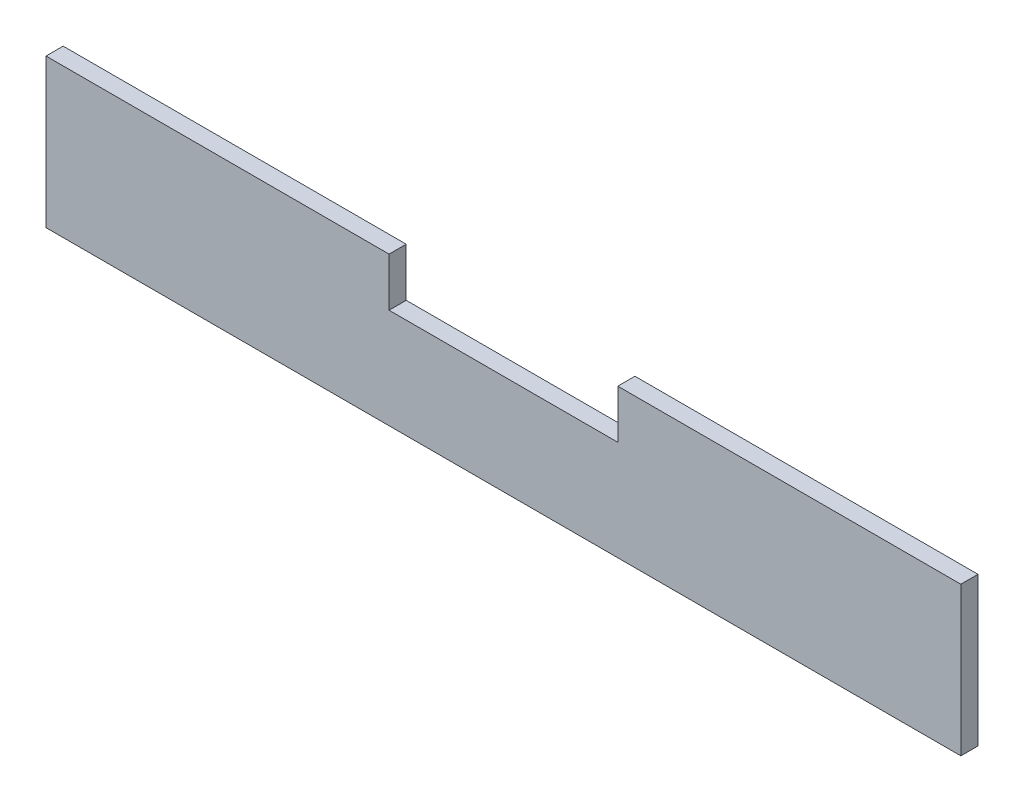
ISO-10303-21;
HEADER;
FILE_DESCRIPTION(('STEP AP214'),'2;1');
FILE_NAME('part.step','',(''),(''),'','','');
FILE_SCHEMA(('AUTOMOTIVE_DESIGN { 1 0 10303 214 1 1 1 1 }'));
ENDSEC;
DATA;
#1=APPLICATION_CONTEXT('core data for automotive mechanical design processes');
#2=APPLICATION_PROTOCOL_DEFINITION('international standard','automotive_design',2000,#1);
#3=PRODUCT_CONTEXT('',#1,'mechanical');
#4=PRODUCT('Part','Part','',(#3));
#5=PRODUCT_RELATED_PRODUCT_CATEGORY('part','',(#4));
#6=PRODUCT_DEFINITION_FORMATION('','',#4);
#7=PRODUCT_DEFINITION_CONTEXT('part definition',#1,'design');
#8=PRODUCT_DEFINITION('design','',#6,#7);
#9=PRODUCT_DEFINITION_SHAPE('','',#8);
#10=(LENGTH_UNIT() NAMED_UNIT(*) SI_UNIT(.MILLI.,.METRE.));
#11=(NAMED_UNIT(*) PLANE_ANGLE_UNIT() SI_UNIT($,.RADIAN.));
#12=(NAMED_UNIT(*) SI_UNIT($,.STERADIAN.) SOLID_ANGLE_UNIT());
#13=UNCERTAINTY_MEASURE_WITH_UNIT(LENGTH_MEASURE(1.E-05),#10,'distance_accuracy_value','');
#14=(GEOMETRIC_REPRESENTATION_CONTEXT(3) GLOBAL_UNCERTAINTY_ASSIGNED_CONTEXT((#13)) GLOBAL_UNIT_ASSIGNED_CONTEXT((#10,
#11,#12)) REPRESENTATION_CONTEXT('',''));
#15=CARTESIAN_POINT('',(0.,0.,0.));
#16=DIRECTION('',(0.,0.,1.));
#17=DIRECTION('',(1.,0.,0.));
#18=AXIS2_PLACEMENT_3D('',#15,#16,#17);
#19=CARTESIAN_POINT('',(0.,76.2,0.));
#20=DIRECTION('',(0.,1.,0.));
#21=DIRECTION('',(0.,0.,1.));
#22=AXIS2_PLACEMENT_3D('',#19,#20,#21);
#23=PLANE('',#22);
#24=DIRECTION('',(0.,0.,-1.));
#25=VECTOR('',#24,1.);
#26=CARTESIAN_POINT('',(127.,76.2,-1035.05));
#27=LINE('',#26,#25);
#28=CARTESIAN_POINT('',(127.,76.2,1035.05));
#29=VERTEX_POINT('',#28);
#30=CARTESIAN_POINT('',(127.,76.2,1016.));
#31=VERTEX_POINT('',#30);
#32=EDGE_CURVE('E112',#29,#31,#27,.T.);
#33=ORIENTED_EDGE('',*,*,#32,.F.);
#34=DIRECTION('',(1.,0.,0.));
#35=VECTOR('',#34,1.);
#36=CARTESIAN_POINT('',(0.,76.2,1035.05));
#37=LINE('',#36,#35);
#38=CARTESIAN_POINT('',(508.,76.2,1035.05));
#39=VERTEX_POINT('',#38);
#40=EDGE_CURVE('E127',#29,#39,#37,.T.);
#41=ORIENTED_EDGE('',*,*,#40,.T.);
#42=DIRECTION('',(0.,0.,1.));
#43=VECTOR('',#42,1.);
#44=CARTESIAN_POINT('',(508.,76.2,0.));
#45=LINE('',#44,#43);
#46=CARTESIAN_POINT('',(508.,76.2,1016.));
#47=VERTEX_POINT('',#46);
#48=EDGE_CURVE('E126',#47,#39,#45,.T.);
#49=ORIENTED_EDGE('',*,*,#48,.F.);
#50=DIRECTION('',(1.,0.,0.));
#51=VECTOR('',#50,1.);
#52=CARTESIAN_POINT('',(0.,76.2,1016.));
#53=LINE('',#52,#51);
#54=EDGE_CURVE('E60',#31,#47,#53,.T.);
#55=ORIENTED_EDGE('',*,*,#54,.F.);
#56=EDGE_LOOP('',(#33,#41,#49,#55));
#57=FACE_BOUND('',#56,.T.);
#58=ADVANCED_FACE('F38',(#57),#23,.T.);
#59=CARTESIAN_POINT('',(-508.,1092.37857805604,0.));
#60=DIRECTION('',(1.,0.,0.));
#61=DIRECTION('',(0.,0.,-1.));
#62=AXIS2_PLACEMENT_3D('',#59,#60,#61);
#63=PLANE('',#62);
#64=DIRECTION('',(0.,0.,1.));
#65=VECTOR('',#64,1.);
#66=CARTESIAN_POINT('',(-508.,76.2,0.));
#67=LINE('',#66,#65);
#68=CARTESIAN_POINT('',(-508.,76.2,1016.));
#69=VERTEX_POINT('',#68);
#70=CARTESIAN_POINT('',(-508.,76.2,1035.05));
#71=VERTEX_POINT('',#70);
#72=EDGE_CURVE('E124',#69,#71,#67,.T.);
#73=ORIENTED_EDGE('',*,*,#72,.F.);
#74=DIRECTION('',(0.,-1.,0.));
#75=VECTOR('',#74,1.);
#76=CARTESIAN_POINT('',(-508.,1092.37857805604,1016.));
#77=LINE('',#76,#75);
#78=CARTESIAN_POINT('',(-508.,-88.9,1016.));
#79=VERTEX_POINT('',#78);
#80=EDGE_CURVE('E135',#69,#79,#77,.T.);
#81=ORIENTED_EDGE('',*,*,#80,.T.);
#82=DIRECTION('',(0.,0.,-1.));
#83=VECTOR('',#82,1.);
#84=CARTESIAN_POINT('',(-508.,-88.9,0.));
#85=LINE('',#84,#83);
#86=CARTESIAN_POINT('',(-508.,-88.9,1035.05));
#87=VERTEX_POINT('',#86);
#88=EDGE_CURVE('E166',#87,#79,#85,.T.);
#89=ORIENTED_EDGE('',*,*,#88,.F.);
#90=DIRECTION('',(0.,-1.,0.));
#91=VECTOR('',#90,1.);
#92=CARTESIAN_POINT('',(-508.,1092.37857805604,1035.05));
#93=LINE('',#92,#91);
#94=EDGE_CURVE('E137',#71,#87,#93,.T.);
#95=ORIENTED_EDGE('',*,*,#94,.F.);
#96=EDGE_LOOP('',(#73,#81,#89,#95));
#97=FACE_BOUND('',#96,.T.);
#98=ADVANCED_FACE('F172',(#97),#63,.F.);
#99=CARTESIAN_POINT('',(0.,-88.9,0.));
#100=DIRECTION('',(0.,1.,0.));
#101=DIRECTION('',(0.,0.,1.));
#102=AXIS2_PLACEMENT_3D('',#99,#100,#101);
#103=PLANE('',#102);
#104=DIRECTION('',(0.,0.,-1.));
#105=VECTOR('',#104,1.);
#106=CARTESIAN_POINT('',(508.,-88.9,0.));
#107=LINE('',#106,#105);
#108=CARTESIAN_POINT('',(508.,-88.9,1035.05));
#109=VERTEX_POINT('',#108);
#110=CARTESIAN_POINT('',(508.,-88.9,1016.));
#111=VERTEX_POINT('',#110);
#112=EDGE_CURVE('E160',#109,#111,#107,.T.);
#113=ORIENTED_EDGE('',*,*,#112,.F.);
#114=DIRECTION('',(-1.,0.,0.));
#115=VECTOR('',#114,1.);
#116=CARTESIAN_POINT('',(0.,-88.9,1035.05));
#117=LINE('',#116,#115);
#118=EDGE_CURVE('E152',#109,#87,#117,.T.);
#119=ORIENTED_EDGE('',*,*,#118,.T.);
#120=ORIENTED_EDGE('',*,*,#88,.T.);
#121=DIRECTION('',(-1.,0.,0.));
#122=VECTOR('',#121,1.);
#123=CARTESIAN_POINT('',(0.,-88.9,1016.));
#124=LINE('',#123,#122);
#125=EDGE_CURVE('E163',#111,#79,#124,.T.);
#126=ORIENTED_EDGE('',*,*,#125,.F.);
#127=EDGE_LOOP('',(#113,#119,#120,#126));
#128=FACE_BOUND('',#127,.T.);
#129=ADVANCED_FACE('F177',(#128),#103,.F.);
#130=CARTESIAN_POINT('',(508.,1092.37857805604,0.));
#131=DIRECTION('',(1.,0.,0.));
#132=DIRECTION('',(0.,0.,-1.));
#133=AXIS2_PLACEMENT_3D('',#130,#131,#132);
#134=PLANE('',#133);
#135=DIRECTION('',(0.,-1.,0.));
#136=VECTOR('',#135,1.);
#137=CARTESIAN_POINT('',(508.,1092.37857805604,1016.));
#138=LINE('',#137,#136);
#139=EDGE_CURVE('E140',#47,#111,#138,.T.);
#140=ORIENTED_EDGE('',*,*,#139,.F.);
#141=ORIENTED_EDGE('',*,*,#48,.T.);
#142=DIRECTION('',(0.,-1.,0.));
#143=VECTOR('',#142,1.);
#144=CARTESIAN_POINT('',(508.,1092.37857805604,1035.05));
#145=LINE('',#144,#143);
#146=EDGE_CURVE('E130',#39,#109,#145,.T.);
#147=ORIENTED_EDGE('',*,*,#146,.T.);
#148=ORIENTED_EDGE('',*,*,#112,.T.);
#149=EDGE_LOOP('',(#140,#141,#147,#148));
#150=FACE_BOUND('',#149,.T.);
#151=ADVANCED_FACE('F180',(#150),#134,.T.);
#152=CARTESIAN_POINT('',(0.,1092.37857805604,1035.05));
#153=DIRECTION('',(0.,0.,-1.));
#154=DIRECTION('',(-1.,0.,0.));
#155=AXIS2_PLACEMENT_3D('',#152,#153,#154);
#156=PLANE('',#155);
#157=DIRECTION('',(-1.,0.,0.));
#158=VECTOR('',#157,1.);
#159=CARTESIAN_POINT('',(-127.,22.2250000000002,1035.05));
#160=LINE('',#159,#158);
#161=CARTESIAN_POINT('',(127.,22.2250000000002,1035.05));
#162=VERTEX_POINT('',#161);
#163=CARTESIAN_POINT('',(-127.,22.2250000000002,1035.05));
#164=VERTEX_POINT('',#163);
#165=EDGE_CURVE('E119',#162,#164,#160,.T.);
#166=ORIENTED_EDGE('',*,*,#165,.T.);
#167=DIRECTION('',(0.,1.,0.));
#168=VECTOR('',#167,1.);
#169=CARTESIAN_POINT('',(-127.,-2063.39960907998,1035.05));
#170=LINE('',#169,#168);
#171=CARTESIAN_POINT('',(-127.,76.2,1035.05));
#172=VERTEX_POINT('',#171);
#173=EDGE_CURVE('E106',#164,#172,#170,.T.);
#174=ORIENTED_EDGE('',*,*,#173,.T.);
#175=EDGE_CURVE('E117',#71,#172,#37,.T.);
#176=ORIENTED_EDGE('',*,*,#175,.F.);
#177=ORIENTED_EDGE('',*,*,#94,.T.);
#178=ORIENTED_EDGE('',*,*,#118,.F.);
#179=ORIENTED_EDGE('',*,*,#146,.F.);
#180=ORIENTED_EDGE('',*,*,#40,.F.);
#181=DIRECTION('',(0.,1.,0.));
#182=VECTOR('',#181,1.);
#183=CARTESIAN_POINT('',(127.,-2063.39960907998,1035.05));
#184=LINE('',#183,#182);
#185=EDGE_CURVE('E120',#162,#29,#184,.T.);
#186=ORIENTED_EDGE('',*,*,#185,.F.);
#187=EDGE_LOOP('',(#166,#174,#176,#177,#178,#179,#180,#186));
#188=FACE_BOUND('',#187,.T.);
#189=ADVANCED_FACE('F116',(#188),#156,.F.);
#190=CARTESIAN_POINT('',(0.,22.225,0.));
#191=DIRECTION('',(0.,1.,0.));
#192=DIRECTION('',(0.,0.,1.));
#193=AXIS2_PLACEMENT_3D('',#190,#191,#192);
#194=PLANE('',#193);
#195=DIRECTION('',(0.,0.,-1.));
#196=VECTOR('',#195,1.);
#197=CARTESIAN_POINT('',(-127.,22.2250000000002,-1035.05));
#198=LINE('',#197,#196);
#199=CARTESIAN_POINT('',(-127.,22.2250000000002,1016.));
#200=VERTEX_POINT('',#199);
#201=EDGE_CURVE('E150',#164,#200,#198,.T.);
#202=ORIENTED_EDGE('',*,*,#201,.F.);
#203=ORIENTED_EDGE('',*,*,#165,.F.);
#204=DIRECTION('',(0.,0.,1.));
#205=VECTOR('',#204,1.);
#206=CARTESIAN_POINT('',(127.,22.2250000000002,-1035.05));
#207=LINE('',#206,#205);
#208=CARTESIAN_POINT('',(127.,22.2249999999999,1016.));
#209=VERTEX_POINT('',#208);
#210=EDGE_CURVE('E52',#209,#162,#207,.T.);
#211=ORIENTED_EDGE('',*,*,#210,.F.);
#212=DIRECTION('',(1.,0.,0.));
#213=VECTOR('',#212,1.);
#214=CARTESIAN_POINT('',(0.,22.2249999999999,1016.));
#215=LINE('',#214,#213);
#216=EDGE_CURVE('E142',#200,#209,#215,.T.);
#217=ORIENTED_EDGE('',*,*,#216,.F.);
#218=EDGE_LOOP('',(#202,#203,#211,#217));
#219=FACE_BOUND('',#218,.T.);
#220=ADVANCED_FACE('F149',(#219),#194,.T.);
#221=CARTESIAN_POINT('',(0.,1092.37857805604,1016.));
#222=DIRECTION('',(0.,0.,-1.));
#223=DIRECTION('',(-1.,0.,0.));
#224=AXIS2_PLACEMENT_3D('',#221,#222,#223);
#225=PLANE('',#224);
#226=DIRECTION('',(0.,1.,0.));
#227=VECTOR('',#226,1.);
#228=CARTESIAN_POINT('',(-127.,1092.37857805604,1016.));
#229=LINE('',#228,#227);
#230=CARTESIAN_POINT('',(-127.,76.2,1016.));
#231=VERTEX_POINT('',#230);
#232=EDGE_CURVE('E11',#200,#231,#229,.T.);
#233=ORIENTED_EDGE('',*,*,#232,.F.);
#234=ORIENTED_EDGE('',*,*,#216,.T.);
#235=DIRECTION('',(0.,-1.,0.));
#236=VECTOR('',#235,1.);
#237=CARTESIAN_POINT('',(127.,1092.37857805604,1016.));
#238=LINE('',#237,#236);
#239=EDGE_CURVE('E45',#31,#209,#238,.T.);
#240=ORIENTED_EDGE('',*,*,#239,.F.);
#241=ORIENTED_EDGE('',*,*,#54,.T.);
#242=ORIENTED_EDGE('',*,*,#139,.T.);
#243=ORIENTED_EDGE('',*,*,#125,.T.);
#244=ORIENTED_EDGE('',*,*,#80,.F.);
#245=EDGE_CURVE('E143',#69,#231,#53,.T.);
#246=ORIENTED_EDGE('',*,*,#245,.T.);
#247=EDGE_LOOP('',(#233,#234,#240,#241,#242,#243,#244,#246));
#248=FACE_BOUND('',#247,.T.);
#249=ADVANCED_FACE('F148',(#248),#225,.T.);
#250=CARTESIAN_POINT('',(127.,-2063.39960907998,-1035.05));
#251=DIRECTION('',(1.,0.,0.));
#252=DIRECTION('',(0.,0.,-1.));
#253=AXIS2_PLACEMENT_3D('',#250,#251,#252);
#254=PLANE('',#253);
#255=ORIENTED_EDGE('',*,*,#239,.T.);
#256=ORIENTED_EDGE('',*,*,#210,.T.);
#257=ORIENTED_EDGE('',*,*,#185,.T.);
#258=ORIENTED_EDGE('',*,*,#32,.T.);
#259=EDGE_LOOP('',(#255,#256,#257,#258));
#260=FACE_BOUND('',#259,.T.);
#261=ADVANCED_FACE('F146',(#260),#254,.F.);
#262=CARTESIAN_POINT('',(-127.,-2063.39960907998,-1035.05));
#263=DIRECTION('',(-1.,0.,0.));
#264=DIRECTION('',(0.,0.,1.));
#265=AXIS2_PLACEMENT_3D('',#262,#263,#264);
#266=PLANE('',#265);
#267=ORIENTED_EDGE('',*,*,#232,.T.);
#268=DIRECTION('',(0.,0.,1.));
#269=VECTOR('',#268,1.);
#270=CARTESIAN_POINT('',(-127.,76.2,-1035.05));
#271=LINE('',#270,#269);
#272=EDGE_CURVE('E102',#231,#172,#271,.T.);
#273=ORIENTED_EDGE('',*,*,#272,.T.);
#274=ORIENTED_EDGE('',*,*,#173,.F.);
#275=ORIENTED_EDGE('',*,*,#201,.T.);
#276=EDGE_LOOP('',(#267,#273,#274,#275));
#277=FACE_BOUND('',#276,.T.);
#278=ADVANCED_FACE('F104',(#277),#266,.F.);
#279=ORIENTED_EDGE('',*,*,#272,.F.);
#280=ORIENTED_EDGE('',*,*,#245,.F.);
#281=ORIENTED_EDGE('',*,*,#72,.T.);
#282=ORIENTED_EDGE('',*,*,#175,.T.);
#283=EDGE_LOOP('',(#279,#280,#281,#282));
#284=FACE_BOUND('',#283,.T.);
#285=ADVANCED_FACE('F122',(#284),#23,.T.);
#286=CLOSED_SHELL('',(#58,#98,#129,#151,#189,#220,#249,#261,#278,#285));
#287=MANIFOLD_SOLID_BREP('B2',#286);
#288=ADVANCED_BREP_SHAPE_REPRESENTATION('',(#18,#287),#14);
#289=SHAPE_DEFINITION_REPRESENTATION(#9,#288);
ENDSEC;
END-ISO-10303-21;
